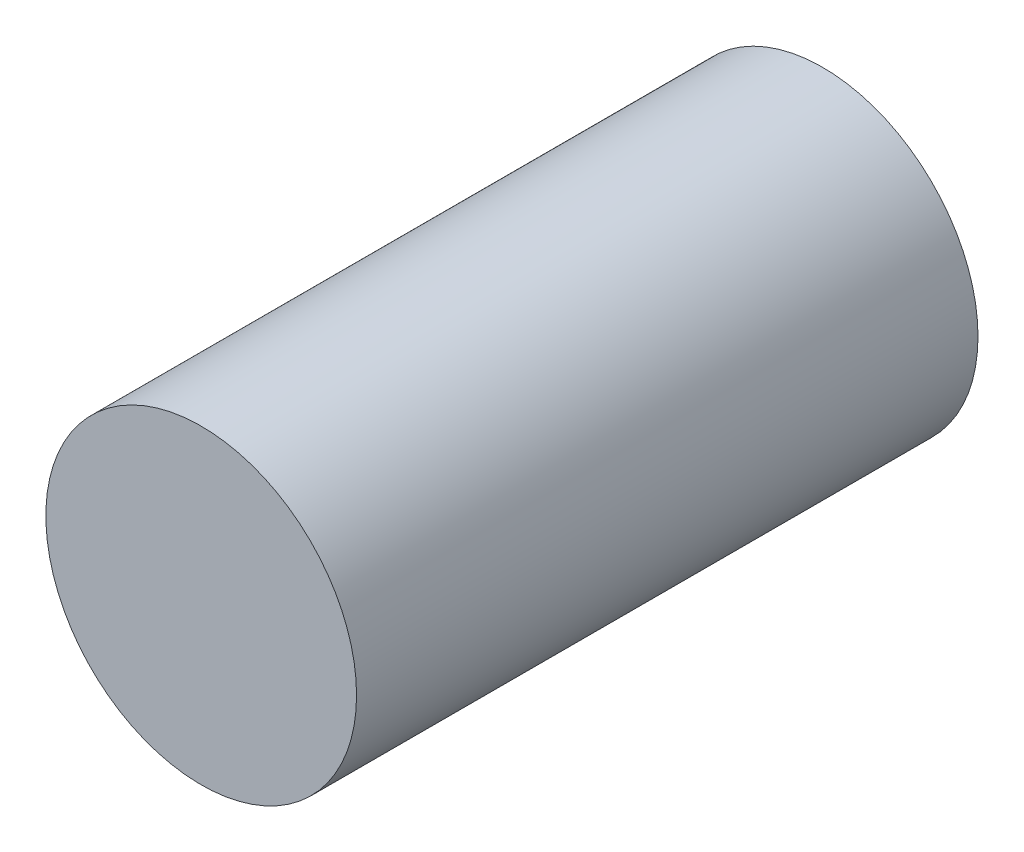
ISO-10303-21;
HEADER;
FILE_DESCRIPTION(('STEP AP214'),'2;1');
FILE_NAME('part.step','',(''),(''),'','','');
FILE_SCHEMA(('AUTOMOTIVE_DESIGN { 1 0 10303 214 1 1 1 1 }'));
ENDSEC;
DATA;
#1=APPLICATION_CONTEXT('core data for automotive mechanical design processes');
#2=APPLICATION_PROTOCOL_DEFINITION('international standard','automotive_design',2000,#1);
#3=PRODUCT_CONTEXT('',#1,'mechanical');
#4=PRODUCT('Part','Part','',(#3));
#5=PRODUCT_RELATED_PRODUCT_CATEGORY('part','',(#4));
#6=PRODUCT_DEFINITION_FORMATION('','',#4);
#7=PRODUCT_DEFINITION_CONTEXT('part definition',#1,'design');
#8=PRODUCT_DEFINITION('design','',#6,#7);
#9=PRODUCT_DEFINITION_SHAPE('','',#8);
#10=(LENGTH_UNIT() NAMED_UNIT(*) SI_UNIT(.MILLI.,.METRE.));
#11=(NAMED_UNIT(*) PLANE_ANGLE_UNIT() SI_UNIT($,.RADIAN.));
#12=(NAMED_UNIT(*) SI_UNIT($,.STERADIAN.) SOLID_ANGLE_UNIT());
#13=UNCERTAINTY_MEASURE_WITH_UNIT(LENGTH_MEASURE(1.E-05),#10,'distance_accuracy_value','');
#14=(GEOMETRIC_REPRESENTATION_CONTEXT(3) GLOBAL_UNCERTAINTY_ASSIGNED_CONTEXT((#13)) GLOBAL_UNIT_ASSIGNED_CONTEXT((#10,
#11,#12)) REPRESENTATION_CONTEXT('',''));
#15=CARTESIAN_POINT('',(0.,0.,0.));
#16=DIRECTION('',(0.,0.,1.));
#17=DIRECTION('',(1.,0.,0.));
#18=AXIS2_PLACEMENT_3D('',#15,#16,#17);
#19=CARTESIAN_POINT('',(0.,0.,2.00000108));
#20=DIRECTION('',(0.,0.,1.));
#21=DIRECTION('',(1.,0.,0.));
#22=AXIS2_PLACEMENT_3D('',#19,#20,#21);
#23=PLANE('',#22);
#24=CARTESIAN_POINT('',(0.,0.,2.00000108));
#25=DIRECTION('',(0.,0.,1.));
#26=DIRECTION('',(1.,0.,0.));
#27=AXIS2_PLACEMENT_3D('',#24,#25,#26);
#28=CIRCLE('',#27,0.499999);
#29=CARTESIAN_POINT('',(0.499999,0.,2.00000108));
#30=VERTEX_POINT('',#29);
#31=EDGE_CURVE('E11',#30,#30,#28,.T.);
#32=ORIENTED_EDGE('',*,*,#31,.T.);
#33=EDGE_LOOP('',(#32));
#34=FACE_BOUND('',#33,.T.);
#35=ADVANCED_FACE('F17',(#34),#23,.T.);
#36=CARTESIAN_POINT('',(0.,0.,0.));
#37=DIRECTION('',(0.,0.,1.));
#38=DIRECTION('',(1.,0.,0.));
#39=AXIS2_PLACEMENT_3D('',#36,#37,#38);
#40=PLANE('',#39);
#41=CARTESIAN_POINT('',(0.,0.,0.));
#42=DIRECTION('',(0.,0.,1.));
#43=DIRECTION('',(1.,0.,0.));
#44=AXIS2_PLACEMENT_3D('',#41,#42,#43);
#45=CIRCLE('',#44,0.499999);
#46=CARTESIAN_POINT('',(0.499999,0.,0.));
#47=VERTEX_POINT('',#46);
#48=EDGE_CURVE('E42',#47,#47,#45,.T.);
#49=ORIENTED_EDGE('',*,*,#48,.F.);
#50=EDGE_LOOP('',(#49));
#51=FACE_BOUND('',#50,.T.);
#52=ADVANCED_FACE('F56',(#51),#40,.F.);
#53=CARTESIAN_POINT('',(0.,0.,0.));
#54=DIRECTION('',(0.,0.,-1.));
#55=DIRECTION('',(1.,0.,0.));
#56=AXIS2_PLACEMENT_3D('',#53,#54,#55);
#57=CYLINDRICAL_SURFACE('',#56,0.499999);
#58=ORIENTED_EDGE('',*,*,#48,.T.);
#59=DIRECTION('',(0.,0.,1.));
#60=VECTOR('',#59,1.);
#61=CARTESIAN_POINT('',(0.499999,0.,0.));
#62=LINE('',#61,#60);
#63=EDGE_CURVE('E25',#47,#30,#62,.T.);
#64=ORIENTED_EDGE('',*,*,#63,.T.);
#65=ORIENTED_EDGE('',*,*,#31,.F.);
#66=ORIENTED_EDGE('',*,*,#63,.F.);
#67=EDGE_LOOP('',(#58,#64,#65,#66));
#68=FACE_BOUND('',#67,.T.);
#69=ADVANCED_FACE('F40',(#68),#57,.T.);
#70=CLOSED_SHELL('',(#35,#52,#69));
#71=MANIFOLD_SOLID_BREP('B1',#70);
#72=ADVANCED_BREP_SHAPE_REPRESENTATION('',(#18,#71),#14);
#73=SHAPE_DEFINITION_REPRESENTATION(#9,#72);
ENDSEC;
END-ISO-10303-21;
